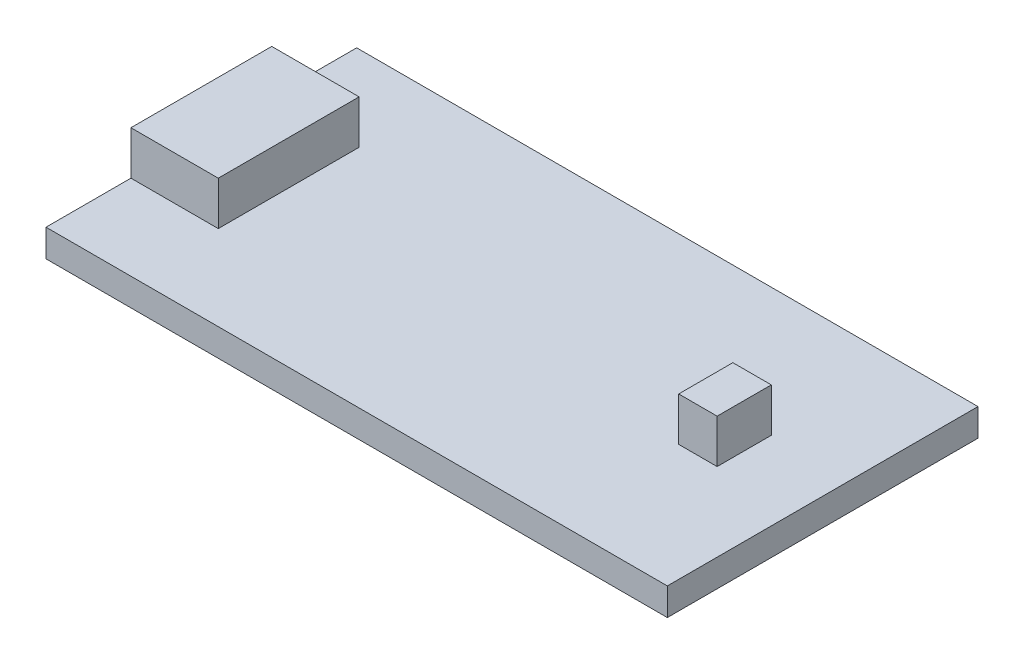
ISO-10303-21;
HEADER;
FILE_DESCRIPTION(('STEP AP214'),'2;1');
FILE_NAME('part.step','',(''),(''),'','','');
FILE_SCHEMA(('AUTOMOTIVE_DESIGN { 1 0 10303 214 1 1 1 1 }'));
ENDSEC;
DATA;
#1=APPLICATION_CONTEXT('core data for automotive mechanical design processes');
#2=APPLICATION_PROTOCOL_DEFINITION('international standard','automotive_design',2000,#1);
#3=PRODUCT_CONTEXT('',#1,'mechanical');
#4=PRODUCT('Part','Part','',(#3));
#5=PRODUCT_RELATED_PRODUCT_CATEGORY('part','',(#4));
#6=PRODUCT_DEFINITION_FORMATION('','',#4);
#7=PRODUCT_DEFINITION_CONTEXT('part definition',#1,'design');
#8=PRODUCT_DEFINITION('design','',#6,#7);
#9=PRODUCT_DEFINITION_SHAPE('','',#8);
#10=(LENGTH_UNIT() NAMED_UNIT(*) SI_UNIT(.MILLI.,.METRE.));
#11=(NAMED_UNIT(*) PLANE_ANGLE_UNIT() SI_UNIT($,.RADIAN.));
#12=(NAMED_UNIT(*) SI_UNIT($,.STERADIAN.) SOLID_ANGLE_UNIT());
#13=UNCERTAINTY_MEASURE_WITH_UNIT(LENGTH_MEASURE(1.E-05),#10,'distance_accuracy_value','');
#14=(GEOMETRIC_REPRESENTATION_CONTEXT(3) GLOBAL_UNCERTAINTY_ASSIGNED_CONTEXT((#13)) GLOBAL_UNIT_ASSIGNED_CONTEXT((#10,
#11,#12)) REPRESENTATION_CONTEXT('',''));
#15=CARTESIAN_POINT('',(0.,0.,0.));
#16=DIRECTION('',(0.,0.,1.));
#17=DIRECTION('',(1.,0.,0.));
#18=AXIS2_PLACEMENT_3D('',#15,#16,#17);
#19=CARTESIAN_POINT('',(0.,1.57,0.));
#20=DIRECTION('',(0.,1.,0.));
#21=DIRECTION('',(0.,0.,1.));
#22=AXIS2_PLACEMENT_3D('',#19,#20,#21);
#23=PLANE('',#22);
#24=DIRECTION('',(1.,0.,0.));
#25=VECTOR('',#24,1.);
#26=CARTESIAN_POINT('',(-17.78,1.57,4.03));
#27=LINE('',#26,#25);
#28=CARTESIAN_POINT('',(-17.78,1.57,4.03));
#29=VERTEX_POINT('',#28);
#30=CARTESIAN_POINT('',(-12.78,1.57,4.03));
#31=VERTEX_POINT('',#30);
#32=EDGE_CURVE('E164',#29,#31,#27,.T.);
#33=ORIENTED_EDGE('',*,*,#32,.F.);
#34=DIRECTION('',(0.,0.,1.));
#35=VECTOR('',#34,1.);
#36=CARTESIAN_POINT('',(-17.78,1.57,-8.89000000000001));
#37=LINE('',#36,#35);
#38=CARTESIAN_POINT('',(-17.78,1.57,8.89000000000001));
#39=VERTEX_POINT('',#38);
#40=EDGE_CURVE('E192',#29,#39,#37,.T.);
#41=ORIENTED_EDGE('',*,*,#40,.T.);
#42=DIRECTION('',(1.,0.,0.));
#43=VECTOR('',#42,1.);
#44=CARTESIAN_POINT('',(-17.78,1.57,8.89000000000001));
#45=LINE('',#44,#43);
#46=CARTESIAN_POINT('',(17.78,1.57,8.89000000000001));
#47=VERTEX_POINT('',#46);
#48=EDGE_CURVE('E195',#39,#47,#45,.T.);
#49=ORIENTED_EDGE('',*,*,#48,.T.);
#50=DIRECTION('',(0.,0.,-1.));
#51=VECTOR('',#50,1.);
#52=CARTESIAN_POINT('',(17.78,1.57,-8.89000000000001));
#53=LINE('',#52,#51);
#54=CARTESIAN_POINT('',(17.78,1.57,-8.89000000000001));
#55=VERTEX_POINT('',#54);
#56=EDGE_CURVE('E186',#47,#55,#53,.T.);
#57=ORIENTED_EDGE('',*,*,#56,.T.);
#58=DIRECTION('',(-1.,0.,0.));
#59=VECTOR('',#58,1.);
#60=CARTESIAN_POINT('',(-17.78,1.57,-8.89000000000001));
#61=LINE('',#60,#59);
#62=CARTESIAN_POINT('',(-17.78,1.57,-8.89000000000001));
#63=VERTEX_POINT('',#62);
#64=EDGE_CURVE('E189',#55,#63,#61,.T.);
#65=ORIENTED_EDGE('',*,*,#64,.T.);
#66=CARTESIAN_POINT('',(-17.78,1.57,-4.03));
#67=VERTEX_POINT('',#66);
#68=EDGE_CURVE('E193',#63,#67,#37,.T.);
#69=ORIENTED_EDGE('',*,*,#68,.T.);
#70=DIRECTION('',(-1.,0.,0.));
#71=VECTOR('',#70,1.);
#72=CARTESIAN_POINT('',(-17.78,1.57,-4.03));
#73=LINE('',#72,#71);
#74=CARTESIAN_POINT('',(-12.78,1.57,-4.03));
#75=VERTEX_POINT('',#74);
#76=EDGE_CURVE('E155',#75,#67,#73,.T.);
#77=ORIENTED_EDGE('',*,*,#76,.F.);
#78=DIRECTION('',(0.,0.,-1.));
#79=VECTOR('',#78,1.);
#80=CARTESIAN_POINT('',(-12.78,1.57,4.03));
#81=LINE('',#80,#79);
#82=EDGE_CURVE('E63',#31,#75,#81,.T.);
#83=ORIENTED_EDGE('',*,*,#82,.F.);
#84=EDGE_LOOP('',(#33,#41,#49,#57,#65,#69,#77,#83));
#85=FACE_BOUND('',#84,.T.);
#86=DIRECTION('',(-1.,0.,0.));
#87=VECTOR('',#86,1.);
#88=CARTESIAN_POINT('',(11.09,1.57,-1.55));
#89=LINE('',#88,#87);
#90=CARTESIAN_POINT('',(13.29,1.57,-1.55));
#91=VERTEX_POINT('',#90);
#92=CARTESIAN_POINT('',(11.09,1.57,-1.55));
#93=VERTEX_POINT('',#92);
#94=EDGE_CURVE('E370',#91,#93,#89,.T.);
#95=ORIENTED_EDGE('',*,*,#94,.F.);
#96=DIRECTION('',(0.,0.,-1.));
#97=VECTOR('',#96,1.);
#98=CARTESIAN_POINT('',(13.29,1.57,1.55));
#99=LINE('',#98,#97);
#100=CARTESIAN_POINT('',(13.29,1.57,1.55));
#101=VERTEX_POINT('',#100);
#102=EDGE_CURVE('E152',#101,#91,#99,.T.);
#103=ORIENTED_EDGE('',*,*,#102,.F.);
#104=DIRECTION('',(1.,0.,0.));
#105=VECTOR('',#104,1.);
#106=CARTESIAN_POINT('',(11.09,1.57,1.55));
#107=LINE('',#106,#105);
#108=CARTESIAN_POINT('',(11.09,1.57,1.55));
#109=VERTEX_POINT('',#108);
#110=EDGE_CURVE('E148',#109,#101,#107,.T.);
#111=ORIENTED_EDGE('',*,*,#110,.F.);
#112=DIRECTION('',(0.,0.,1.));
#113=VECTOR('',#112,1.);
#114=CARTESIAN_POINT('',(11.09,1.57,1.55));
#115=LINE('',#114,#113);
#116=EDGE_CURVE('E367',#93,#109,#115,.T.);
#117=ORIENTED_EDGE('',*,*,#116,.F.);
#118=EDGE_LOOP('',(#95,#103,#111,#117));
#119=FACE_BOUND('',#118,.T.);
#120=ADVANCED_FACE('F40',(#85,#119),#23,.T.);
#121=CARTESIAN_POINT('',(17.78,1.57,-8.89000000000001));
#122=DIRECTION('',(-1.,0.,0.));
#123=DIRECTION('',(0.,0.,1.));
#124=AXIS2_PLACEMENT_3D('',#121,#122,#123);
#125=PLANE('',#124);
#126=DIRECTION('',(0.,0.,-1.));
#127=VECTOR('',#126,1.);
#128=CARTESIAN_POINT('',(17.78,0.,-8.89000000000001));
#129=LINE('',#128,#127);
#130=CARTESIAN_POINT('',(17.78,0.,8.89000000000001));
#131=VERTEX_POINT('',#130);
#132=CARTESIAN_POINT('',(17.78,0.,-8.89000000000001));
#133=VERTEX_POINT('',#132);
#134=EDGE_CURVE('E185',#131,#133,#129,.T.);
#135=ORIENTED_EDGE('',*,*,#134,.T.);
#136=DIRECTION('',(0.,-1.,0.));
#137=VECTOR('',#136,1.);
#138=CARTESIAN_POINT('',(17.78,1.57,-8.89000000000001));
#139=LINE('',#138,#137);
#140=EDGE_CURVE('E11',#55,#133,#139,.T.);
#141=ORIENTED_EDGE('',*,*,#140,.F.);
#142=ORIENTED_EDGE('',*,*,#56,.F.);
#143=DIRECTION('',(0.,-1.,0.));
#144=VECTOR('',#143,1.);
#145=CARTESIAN_POINT('',(17.78,1.57,8.89000000000001));
#146=LINE('',#145,#144);
#147=EDGE_CURVE('E197',#47,#131,#146,.T.);
#148=ORIENTED_EDGE('',*,*,#147,.T.);
#149=EDGE_LOOP('',(#135,#141,#142,#148));
#150=FACE_BOUND('',#149,.T.);
#151=ADVANCED_FACE('F42',(#150),#125,.F.);
#152=CARTESIAN_POINT('',(-17.78,1.57,-8.89000000000001));
#153=DIRECTION('',(0.,0.,1.));
#154=DIRECTION('',(1.,0.,0.));
#155=AXIS2_PLACEMENT_3D('',#152,#153,#154);
#156=PLANE('',#155);
#157=DIRECTION('',(-1.,0.,0.));
#158=VECTOR('',#157,1.);
#159=CARTESIAN_POINT('',(-17.78,0.,-8.89000000000001));
#160=LINE('',#159,#158);
#161=CARTESIAN_POINT('',(-17.78,0.,-8.89000000000001));
#162=VERTEX_POINT('',#161);
#163=EDGE_CURVE('E200',#133,#162,#160,.T.);
#164=ORIENTED_EDGE('',*,*,#163,.T.);
#165=DIRECTION('',(0.,-1.,0.));
#166=VECTOR('',#165,1.);
#167=CARTESIAN_POINT('',(-17.78,1.57,-8.89000000000001));
#168=LINE('',#167,#166);
#169=EDGE_CURVE('E48',#63,#162,#168,.T.);
#170=ORIENTED_EDGE('',*,*,#169,.F.);
#171=ORIENTED_EDGE('',*,*,#64,.F.);
#172=ORIENTED_EDGE('',*,*,#140,.T.);
#173=EDGE_LOOP('',(#164,#170,#171,#172));
#174=FACE_BOUND('',#173,.T.);
#175=ADVANCED_FACE('F258',(#174),#156,.F.);
#176=CARTESIAN_POINT('',(-17.78,1.57,-8.89000000000001));
#177=DIRECTION('',(1.,0.,0.));
#178=DIRECTION('',(0.,0.,-1.));
#179=AXIS2_PLACEMENT_3D('',#176,#177,#178);
#180=PLANE('',#179);
#181=DIRECTION('',(0.,0.,1.));
#182=VECTOR('',#181,1.);
#183=CARTESIAN_POINT('',(-17.78,0.,-8.89000000000001));
#184=LINE('',#183,#182);
#185=CARTESIAN_POINT('',(-17.78,0.,8.89000000000001));
#186=VERTEX_POINT('',#185);
#187=EDGE_CURVE('E202',#162,#186,#184,.T.);
#188=ORIENTED_EDGE('',*,*,#187,.T.);
#189=DIRECTION('',(0.,-1.,0.));
#190=VECTOR('',#189,1.);
#191=CARTESIAN_POINT('',(-17.78,1.57,8.89000000000001));
#192=LINE('',#191,#190);
#193=EDGE_CURVE('E207',#39,#186,#192,.T.);
#194=ORIENTED_EDGE('',*,*,#193,.F.);
#195=ORIENTED_EDGE('',*,*,#40,.F.);
#196=DIRECTION('',(0.,-1.,0.));
#197=VECTOR('',#196,1.);
#198=CARTESIAN_POINT('',(-17.78,4.07,4.03));
#199=LINE('',#198,#197);
#200=CARTESIAN_POINT('',(-17.78,4.07,4.03));
#201=VERTEX_POINT('',#200);
#202=EDGE_CURVE('E176',#201,#29,#199,.T.);
#203=ORIENTED_EDGE('',*,*,#202,.F.);
#204=DIRECTION('',(0.,0.,1.));
#205=VECTOR('',#204,1.);
#206=CARTESIAN_POINT('',(-17.78,4.07,4.03));
#207=LINE('',#206,#205);
#208=CARTESIAN_POINT('',(-17.78,4.07,-4.03));
#209=VERTEX_POINT('',#208);
#210=EDGE_CURVE('E166',#209,#201,#207,.T.);
#211=ORIENTED_EDGE('',*,*,#210,.F.);
#212=DIRECTION('',(0.,-1.,0.));
#213=VECTOR('',#212,1.);
#214=CARTESIAN_POINT('',(-17.78,4.07,-4.03));
#215=LINE('',#214,#213);
#216=EDGE_CURVE('E179',#209,#67,#215,.T.);
#217=ORIENTED_EDGE('',*,*,#216,.T.);
#218=ORIENTED_EDGE('',*,*,#68,.F.);
#219=ORIENTED_EDGE('',*,*,#169,.T.);
#220=EDGE_LOOP('',(#188,#194,#195,#203,#211,#217,#218,#219));
#221=FACE_BOUND('',#220,.T.);
#222=ADVANCED_FACE('F214',(#221),#180,.F.);
#223=CARTESIAN_POINT('',(-17.78,1.57,8.89000000000001));
#224=DIRECTION('',(0.,0.,-1.));
#225=DIRECTION('',(-1.,0.,0.));
#226=AXIS2_PLACEMENT_3D('',#223,#224,#225);
#227=PLANE('',#226);
#228=DIRECTION('',(1.,0.,0.));
#229=VECTOR('',#228,1.);
#230=CARTESIAN_POINT('',(-17.78,0.,8.89000000000001));
#231=LINE('',#230,#229);
#232=EDGE_CURVE('E190',#186,#131,#231,.T.);
#233=ORIENTED_EDGE('',*,*,#232,.T.);
#234=ORIENTED_EDGE('',*,*,#147,.F.);
#235=ORIENTED_EDGE('',*,*,#48,.F.);
#236=ORIENTED_EDGE('',*,*,#193,.T.);
#237=EDGE_LOOP('',(#233,#234,#235,#236));
#238=FACE_BOUND('',#237,.T.);
#239=ADVANCED_FACE('F223',(#238),#227,.F.);
#240=CARTESIAN_POINT('',(0.,0.,0.));
#241=DIRECTION('',(0.,1.,0.));
#242=DIRECTION('',(0.,0.,1.));
#243=AXIS2_PLACEMENT_3D('',#240,#241,#242);
#244=PLANE('',#243);
#245=ORIENTED_EDGE('',*,*,#134,.F.);
#246=ORIENTED_EDGE('',*,*,#232,.F.);
#247=ORIENTED_EDGE('',*,*,#187,.F.);
#248=ORIENTED_EDGE('',*,*,#163,.F.);
#249=EDGE_LOOP('',(#245,#246,#247,#248));
#250=FACE_BOUND('',#249,.T.);
#251=ADVANCED_FACE('F220',(#250),#244,.F.);
#252=CARTESIAN_POINT('',(-12.78,4.07,4.03));
#253=DIRECTION('',(-1.,0.,0.));
#254=DIRECTION('',(0.,0.,1.));
#255=AXIS2_PLACEMENT_3D('',#252,#253,#254);
#256=PLANE('',#255);
#257=ORIENTED_EDGE('',*,*,#82,.T.);
#258=DIRECTION('',(0.,-1.,0.));
#259=VECTOR('',#258,1.);
#260=CARTESIAN_POINT('',(-12.78,4.07,-4.03));
#261=LINE('',#260,#259);
#262=CARTESIAN_POINT('',(-12.78,4.07,-4.03));
#263=VERTEX_POINT('',#262);
#264=EDGE_CURVE('E182',#263,#75,#261,.T.);
#265=ORIENTED_EDGE('',*,*,#264,.F.);
#266=DIRECTION('',(0.,0.,-1.));
#267=VECTOR('',#266,1.);
#268=CARTESIAN_POINT('',(-12.78,4.07,4.03));
#269=LINE('',#268,#267);
#270=CARTESIAN_POINT('',(-12.78,4.07,4.03));
#271=VERTEX_POINT('',#270);
#272=EDGE_CURVE('E160',#271,#263,#269,.T.);
#273=ORIENTED_EDGE('',*,*,#272,.F.);
#274=DIRECTION('',(0.,-1.,0.));
#275=VECTOR('',#274,1.);
#276=CARTESIAN_POINT('',(-12.78,4.07,4.03));
#277=LINE('',#276,#275);
#278=EDGE_CURVE('E169',#271,#31,#277,.T.);
#279=ORIENTED_EDGE('',*,*,#278,.T.);
#280=EDGE_LOOP('',(#257,#265,#273,#279));
#281=FACE_BOUND('',#280,.T.);
#282=ADVANCED_FACE('F244',(#281),#256,.F.);
#283=CARTESIAN_POINT('',(-17.78,4.07,-4.03));
#284=DIRECTION('',(0.,0.,1.));
#285=DIRECTION('',(1.,0.,0.));
#286=AXIS2_PLACEMENT_3D('',#283,#284,#285);
#287=PLANE('',#286);
#288=ORIENTED_EDGE('',*,*,#76,.T.);
#289=ORIENTED_EDGE('',*,*,#216,.F.);
#290=DIRECTION('',(-1.,0.,0.));
#291=VECTOR('',#290,1.);
#292=CARTESIAN_POINT('',(-17.78,4.07,-4.03));
#293=LINE('',#292,#291);
#294=EDGE_CURVE('E163',#263,#209,#293,.T.);
#295=ORIENTED_EDGE('',*,*,#294,.F.);
#296=ORIENTED_EDGE('',*,*,#264,.T.);
#297=EDGE_LOOP('',(#288,#289,#295,#296));
#298=FACE_BOUND('',#297,.T.);
#299=ADVANCED_FACE('F242',(#298),#287,.F.);
#300=CARTESIAN_POINT('',(-17.78,4.07,4.03));
#301=DIRECTION('',(0.,0.,-1.));
#302=DIRECTION('',(-1.,0.,0.));
#303=AXIS2_PLACEMENT_3D('',#300,#301,#302);
#304=PLANE('',#303);
#305=ORIENTED_EDGE('',*,*,#32,.T.);
#306=ORIENTED_EDGE('',*,*,#278,.F.);
#307=DIRECTION('',(1.,0.,0.));
#308=VECTOR('',#307,1.);
#309=CARTESIAN_POINT('',(-17.78,4.07,4.03));
#310=LINE('',#309,#308);
#311=EDGE_CURVE('E168',#201,#271,#310,.T.);
#312=ORIENTED_EDGE('',*,*,#311,.F.);
#313=ORIENTED_EDGE('',*,*,#202,.T.);
#314=EDGE_LOOP('',(#305,#306,#312,#313));
#315=FACE_BOUND('',#314,.T.);
#316=ADVANCED_FACE('F234',(#315),#304,.F.);
#317=CARTESIAN_POINT('',(0.,4.07,0.));
#318=DIRECTION('',(0.,-1.,0.));
#319=DIRECTION('',(0.,0.,-1.));
#320=AXIS2_PLACEMENT_3D('',#317,#318,#319);
#321=PLANE('',#320);
#322=ORIENTED_EDGE('',*,*,#272,.T.);
#323=ORIENTED_EDGE('',*,*,#294,.T.);
#324=ORIENTED_EDGE('',*,*,#210,.T.);
#325=ORIENTED_EDGE('',*,*,#311,.T.);
#326=EDGE_LOOP('',(#322,#323,#324,#325));
#327=FACE_BOUND('',#326,.T.);
#328=ADVANCED_FACE('F238',(#327),#321,.F.);
#329=CARTESIAN_POINT('',(13.29,4.07,1.55));
#330=DIRECTION('',(-1.,0.,0.));
#331=DIRECTION('',(0.,0.,1.));
#332=AXIS2_PLACEMENT_3D('',#329,#330,#331);
#333=PLANE('',#332);
#334=ORIENTED_EDGE('',*,*,#102,.T.);
#335=DIRECTION('',(0.,-1.,0.));
#336=VECTOR('',#335,1.);
#337=CARTESIAN_POINT('',(13.29,4.07,-1.55));
#338=LINE('',#337,#336);
#339=CARTESIAN_POINT('',(13.29,4.07,-1.55));
#340=VERTEX_POINT('',#339);
#341=EDGE_CURVE('E133',#340,#91,#338,.T.);
#342=ORIENTED_EDGE('',*,*,#341,.F.);
#343=DIRECTION('',(0.,0.,-1.));
#344=VECTOR('',#343,1.);
#345=CARTESIAN_POINT('',(13.29,4.07,1.55));
#346=LINE('',#345,#344);
#347=CARTESIAN_POINT('',(13.29,4.07,1.55));
#348=VERTEX_POINT('',#347);
#349=EDGE_CURVE('E140',#348,#340,#346,.T.);
#350=ORIENTED_EDGE('',*,*,#349,.F.);
#351=DIRECTION('',(0.,-1.,0.));
#352=VECTOR('',#351,1.);
#353=CARTESIAN_POINT('',(13.29,4.07,1.55));
#354=LINE('',#353,#352);
#355=EDGE_CURVE('E365',#348,#101,#354,.T.);
#356=ORIENTED_EDGE('',*,*,#355,.T.);
#357=EDGE_LOOP('',(#334,#342,#350,#356));
#358=FACE_BOUND('',#357,.T.);
#359=ADVANCED_FACE('F150',(#358),#333,.F.);
#360=CARTESIAN_POINT('',(11.09,4.07,-1.55));
#361=DIRECTION('',(0.,0.,1.));
#362=DIRECTION('',(1.,0.,0.));
#363=AXIS2_PLACEMENT_3D('',#360,#361,#362);
#364=PLANE('',#363);
#365=ORIENTED_EDGE('',*,*,#94,.T.);
#366=DIRECTION('',(0.,-1.,0.));
#367=VECTOR('',#366,1.);
#368=CARTESIAN_POINT('',(11.09,4.07,-1.55));
#369=LINE('',#368,#367);
#370=CARTESIAN_POINT('',(11.09,4.07,-1.55));
#371=VERTEX_POINT('',#370);
#372=EDGE_CURVE('E136',#371,#93,#369,.T.);
#373=ORIENTED_EDGE('',*,*,#372,.F.);
#374=DIRECTION('',(-1.,0.,0.));
#375=VECTOR('',#374,1.);
#376=CARTESIAN_POINT('',(11.09,4.07,-1.55));
#377=LINE('',#376,#375);
#378=EDGE_CURVE('E129',#340,#371,#377,.T.);
#379=ORIENTED_EDGE('',*,*,#378,.F.);
#380=ORIENTED_EDGE('',*,*,#341,.T.);
#381=EDGE_LOOP('',(#365,#373,#379,#380));
#382=FACE_BOUND('',#381,.T.);
#383=ADVANCED_FACE('F131',(#382),#364,.F.);
#384=CARTESIAN_POINT('',(11.09,4.07,1.55));
#385=DIRECTION('',(1.,0.,0.));
#386=DIRECTION('',(0.,0.,-1.));
#387=AXIS2_PLACEMENT_3D('',#384,#385,#386);
#388=PLANE('',#387);
#389=ORIENTED_EDGE('',*,*,#116,.T.);
#390=DIRECTION('',(0.,-1.,0.));
#391=VECTOR('',#390,1.);
#392=CARTESIAN_POINT('',(11.09,4.07,1.55));
#393=LINE('',#392,#391);
#394=CARTESIAN_POINT('',(11.09,4.07,1.55));
#395=VERTEX_POINT('',#394);
#396=EDGE_CURVE('E55',#395,#109,#393,.T.);
#397=ORIENTED_EDGE('',*,*,#396,.F.);
#398=DIRECTION('',(0.,0.,1.));
#399=VECTOR('',#398,1.);
#400=CARTESIAN_POINT('',(11.09,4.07,1.55));
#401=LINE('',#400,#399);
#402=EDGE_CURVE('E139',#371,#395,#401,.T.);
#403=ORIENTED_EDGE('',*,*,#402,.F.);
#404=ORIENTED_EDGE('',*,*,#372,.T.);
#405=EDGE_LOOP('',(#389,#397,#403,#404));
#406=FACE_BOUND('',#405,.T.);
#407=ADVANCED_FACE('F331',(#406),#388,.F.);
#408=CARTESIAN_POINT('',(11.09,4.07,1.55));
#409=DIRECTION('',(0.,0.,-1.));
#410=DIRECTION('',(-1.,0.,0.));
#411=AXIS2_PLACEMENT_3D('',#408,#409,#410);
#412=PLANE('',#411);
#413=ORIENTED_EDGE('',*,*,#110,.T.);
#414=ORIENTED_EDGE('',*,*,#355,.F.);
#415=DIRECTION('',(1.,0.,0.));
#416=VECTOR('',#415,1.);
#417=CARTESIAN_POINT('',(11.09,4.07,1.55));
#418=LINE('',#417,#416);
#419=EDGE_CURVE('E144',#395,#348,#418,.T.);
#420=ORIENTED_EDGE('',*,*,#419,.F.);
#421=ORIENTED_EDGE('',*,*,#396,.T.);
#422=EDGE_LOOP('',(#413,#414,#420,#421));
#423=FACE_BOUND('',#422,.T.);
#424=ADVANCED_FACE('F339',(#423),#412,.F.);
#425=CARTESIAN_POINT('',(0.,4.07,0.));
#426=DIRECTION('',(0.,-1.,0.));
#427=DIRECTION('',(0.,0.,-1.));
#428=AXIS2_PLACEMENT_3D('',#425,#426,#427);
#429=PLANE('',#428);
#430=ORIENTED_EDGE('',*,*,#349,.T.);
#431=ORIENTED_EDGE('',*,*,#378,.T.);
#432=ORIENTED_EDGE('',*,*,#402,.T.);
#433=ORIENTED_EDGE('',*,*,#419,.T.);
#434=EDGE_LOOP('',(#430,#431,#432,#433));
#435=FACE_BOUND('',#434,.T.);
#436=ADVANCED_FACE('F143',(#435),#429,.F.);
#437=CLOSED_SHELL('',(#120,#151,#175,#222,#239,#251,#282,#299,#316,#328,#359,#383,#407,#424,#436));
#438=MANIFOLD_SOLID_BREP('B2',#437);
#439=ADVANCED_BREP_SHAPE_REPRESENTATION('',(#18,#438),#14);
#440=SHAPE_DEFINITION_REPRESENTATION(#9,#439);
ENDSEC;
END-ISO-10303-21;
